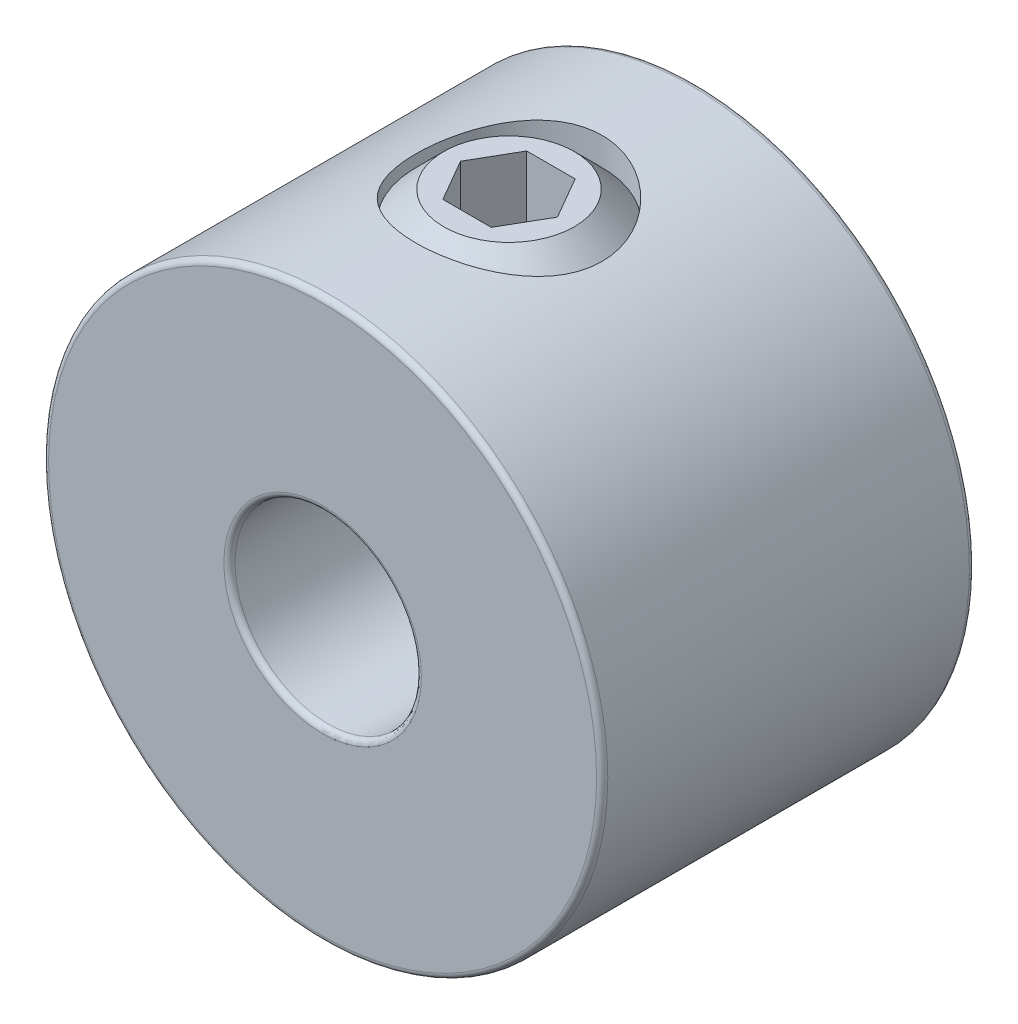
ISO-10303-21;
HEADER;
FILE_DESCRIPTION(('STEP AP214'),'2;1');
FILE_NAME('part.step','',(''),(''),'','','');
FILE_SCHEMA(('AUTOMOTIVE_DESIGN { 1 0 10303 214 1 1 1 1 }'));
ENDSEC;
DATA;
#1=APPLICATION_CONTEXT('core data for automotive mechanical design processes');
#2=APPLICATION_PROTOCOL_DEFINITION('international standard','automotive_design',2000,#1);
#3=PRODUCT_CONTEXT('',#1,'mechanical');
#4=PRODUCT('Part','Part','',(#3));
#5=PRODUCT_RELATED_PRODUCT_CATEGORY('part','',(#4));
#6=PRODUCT_DEFINITION_FORMATION('','',#4);
#7=PRODUCT_DEFINITION_CONTEXT('part definition',#1,'design');
#8=PRODUCT_DEFINITION('design','',#6,#7);
#9=PRODUCT_DEFINITION_SHAPE('','',#8);
#10=(LENGTH_UNIT() NAMED_UNIT(*) SI_UNIT(.MILLI.,.METRE.));
#11=(NAMED_UNIT(*) PLANE_ANGLE_UNIT() SI_UNIT($,.RADIAN.));
#12=(NAMED_UNIT(*) SI_UNIT($,.STERADIAN.) SOLID_ANGLE_UNIT());
#13=UNCERTAINTY_MEASURE_WITH_UNIT(LENGTH_MEASURE(1.E-05),#10,'distance_accuracy_value','');
#14=(GEOMETRIC_REPRESENTATION_CONTEXT(3) GLOBAL_UNCERTAINTY_ASSIGNED_CONTEXT((#13)) GLOBAL_UNIT_ASSIGNED_CONTEXT((#10,
#11,#12)) REPRESENTATION_CONTEXT('',''));
#15=CARTESIAN_POINT('',(0.,0.,0.));
#16=DIRECTION('',(0.,0.,1.));
#17=DIRECTION('',(1.,0.,0.));
#18=AXIS2_PLACEMENT_3D('',#15,#16,#17);
#19=CARTESIAN_POINT('',(0.,0.3,2.));
#20=DIRECTION('',(0.,1.,0.));
#21=DIRECTION('',(-1.,0.,0.));
#22=AXIS2_PLACEMENT_3D('',#19,#20,#21);
#23=CONICAL_SURFACE('',#22,1.,0.785398163397447);
#24=CARTESIAN_POINT('',(0.,0.,2.));
#25=DIRECTION('',(0.,-1.,0.));
#26=DIRECTION('',(1.,0.,0.));
#27=AXIS2_PLACEMENT_3D('',#24,#25,#26);
#28=CIRCLE('',#27,0.7);
#29=CARTESIAN_POINT('',(0.7,0.,2.));
#30=VERTEX_POINT('',#29);
#31=EDGE_CURVE('E12',#30,#30,#28,.T.);
#32=ORIENTED_EDGE('',*,*,#31,.F.);
#33=EDGE_LOOP('',(#32));
#34=FACE_BOUND('',#33,.T.);
#35=CARTESIAN_POINT('',(0.,0.3,2.));
#36=DIRECTION('',(0.,-1.,0.));
#37=DIRECTION('',(1.,0.,0.));
#38=AXIS2_PLACEMENT_3D('',#35,#36,#37);
#39=CIRCLE('',#38,1.);
#40=CARTESIAN_POINT('',(1.,0.3,2.));
#41=VERTEX_POINT('',#40);
#42=EDGE_CURVE('E145',#41,#41,#39,.T.);
#43=ORIENTED_EDGE('',*,*,#42,.T.);
#44=EDGE_LOOP('',(#43));
#45=FACE_BOUND('',#44,.T.);
#46=ADVANCED_FACE('F44',(#34,#45),#23,.T.);
#47=CARTESIAN_POINT('',(0.,0.,2.));
#48=DIRECTION('',(0.,1.,0.));
#49=DIRECTION('',(-1.,0.,0.));
#50=AXIS2_PLACEMENT_3D('',#47,#48,#49);
#51=PLANE('',#50);
#52=ORIENTED_EDGE('',*,*,#31,.T.);
#53=EDGE_LOOP('',(#52));
#54=FACE_BOUND('',#53,.T.);
#55=ADVANCED_FACE('F162',(#54),#51,.F.);
#56=CARTESIAN_POINT('',(0.,3.,2.));
#57=DIRECTION('',(0.,-1.,0.));
#58=DIRECTION('',(1.,0.,0.));
#59=AXIS2_PLACEMENT_3D('',#56,#57,#58);
#60=PLANE('',#59);
#61=DIRECTION('',(0.5,0.,0.866025403784438));
#62=VECTOR('',#61,1.);
#63=CARTESIAN_POINT('',(-0.519615242270676,3.,2.));
#64=LINE('',#63,#62);
#65=CARTESIAN_POINT('',(-0.519615242270676,3.,2.));
#66=VERTEX_POINT('',#65);
#67=CARTESIAN_POINT('',(-0.259807621135343,3.,2.45));
#68=VERTEX_POINT('',#67);
#69=EDGE_CURVE('E132',#66,#68,#64,.T.);
#70=ORIENTED_EDGE('',*,*,#69,.F.);
#71=DIRECTION('',(-0.5,0.,0.866025403784438));
#72=VECTOR('',#71,1.);
#73=CARTESIAN_POINT('',(-0.259807621135346,3.,1.55));
#74=LINE('',#73,#72);
#75=CARTESIAN_POINT('',(-0.259807621135346,3.,1.55));
#76=VERTEX_POINT('',#75);
#77=EDGE_CURVE('E58',#76,#66,#74,.T.);
#78=ORIENTED_EDGE('',*,*,#77,.F.);
#79=DIRECTION('',(-1.,0.,0.));
#80=VECTOR('',#79,1.);
#81=CARTESIAN_POINT('',(0.259807621135324,3.,1.55));
#82=LINE('',#81,#80);
#83=CARTESIAN_POINT('',(0.259807621135324,3.,1.55));
#84=VERTEX_POINT('',#83);
#85=EDGE_CURVE('E141',#84,#76,#82,.T.);
#86=ORIENTED_EDGE('',*,*,#85,.F.);
#87=DIRECTION('',(-0.5,0.,-0.866025403784439));
#88=VECTOR('',#87,1.);
#89=CARTESIAN_POINT('',(0.519615242270654,3.,2.));
#90=LINE('',#89,#88);
#91=CARTESIAN_POINT('',(0.519615242270654,3.,2.));
#92=VERTEX_POINT('',#91);
#93=EDGE_CURVE('E139',#92,#84,#90,.T.);
#94=ORIENTED_EDGE('',*,*,#93,.F.);
#95=DIRECTION('',(0.5,0.,-0.866025403784439));
#96=VECTOR('',#95,1.);
#97=CARTESIAN_POINT('',(0.259807621135322,3.,2.45));
#98=LINE('',#97,#96);
#99=CARTESIAN_POINT('',(0.259807621135322,3.,2.45));
#100=VERTEX_POINT('',#99);
#101=EDGE_CURVE('E106',#100,#92,#98,.T.);
#102=ORIENTED_EDGE('',*,*,#101,.F.);
#103=DIRECTION('',(1.,0.,0.));
#104=VECTOR('',#103,1.);
#105=CARTESIAN_POINT('',(-0.259807621135343,3.,2.45));
#106=LINE('',#105,#104);
#107=EDGE_CURVE('E135',#68,#100,#106,.T.);
#108=ORIENTED_EDGE('',*,*,#107,.F.);
#109=EDGE_LOOP('',(#70,#78,#86,#94,#102,#108));
#110=FACE_BOUND('',#109,.T.);
#111=CARTESIAN_POINT('',(0.,3.,2.));
#112=DIRECTION('',(0.,-1.,0.));
#113=DIRECTION('',(1.,0.,0.));
#114=AXIS2_PLACEMENT_3D('',#111,#112,#113);
#115=CIRCLE('',#114,0.7);
#116=CARTESIAN_POINT('',(0.699999999999999,3.,2.));
#117=VERTEX_POINT('',#116);
#118=EDGE_CURVE('E51',#117,#117,#115,.T.);
#119=ORIENTED_EDGE('',*,*,#118,.F.);
#120=EDGE_LOOP('',(#119));
#121=FACE_BOUND('',#120,.T.);
#122=ADVANCED_FACE('F160',(#110,#121),#60,.F.);
#123=CARTESIAN_POINT('',(0.,3.,2.));
#124=DIRECTION('',(0.,-1.,0.));
#125=DIRECTION('',(1.,0.,0.));
#126=AXIS2_PLACEMENT_3D('',#123,#124,#125);
#127=CONICAL_SURFACE('',#126,0.7,0.785398163397446);
#128=CARTESIAN_POINT('',(0.,2.7,2.));
#129=DIRECTION('',(0.,-1.,0.));
#130=DIRECTION('',(1.,0.,0.));
#131=AXIS2_PLACEMENT_3D('',#128,#129,#130);
#132=CIRCLE('',#131,1.);
#133=CARTESIAN_POINT('',(0.999999999999999,2.7,2.));
#134=VERTEX_POINT('',#133);
#135=EDGE_CURVE('E153',#134,#134,#132,.T.);
#136=ORIENTED_EDGE('',*,*,#135,.F.);
#137=EDGE_LOOP('',(#136));
#138=FACE_BOUND('',#137,.T.);
#139=ORIENTED_EDGE('',*,*,#118,.T.);
#140=EDGE_LOOP('',(#139));
#141=FACE_BOUND('',#140,.T.);
#142=ADVANCED_FACE('F158',(#138,#141),#127,.T.);
#143=CARTESIAN_POINT('',(0.,0.,2.));
#144=DIRECTION('',(0.,-1.,0.));
#145=DIRECTION('',(1.,0.,0.));
#146=AXIS2_PLACEMENT_3D('',#143,#144,#145);
#147=CYLINDRICAL_SURFACE('',#146,1.);
#148=ORIENTED_EDGE('',*,*,#42,.F.);
#149=EDGE_LOOP('',(#148));
#150=FACE_BOUND('',#149,.T.);
#151=ORIENTED_EDGE('',*,*,#135,.T.);
#152=EDGE_LOOP('',(#151));
#153=FACE_BOUND('',#152,.T.);
#154=ADVANCED_FACE('F169',(#150,#153),#147,.T.);
#155=CARTESIAN_POINT('',(-0.259807621135346,2.28,1.55));
#156=DIRECTION('',(-0.866025403784438,0.,-0.5));
#157=DIRECTION('',(-0.5,0.,0.866025403784438));
#158=AXIS2_PLACEMENT_3D('',#155,#156,#157);
#159=PLANE('',#158);
#160=ORIENTED_EDGE('',*,*,#77,.T.);
#161=DIRECTION('',(0.,1.,0.));
#162=VECTOR('',#161,1.);
#163=CARTESIAN_POINT('',(-0.519615242270676,2.28,2.));
#164=LINE('',#163,#162);
#165=CARTESIAN_POINT('',(-0.519615242270676,2.28,2.));
#166=VERTEX_POINT('',#165);
#167=EDGE_CURVE('E88',#166,#66,#164,.T.);
#168=ORIENTED_EDGE('',*,*,#167,.F.);
#169=DIRECTION('',(-0.5,0.,0.866025403784438));
#170=VECTOR('',#169,1.);
#171=CARTESIAN_POINT('',(-0.259807621135346,2.28,1.55));
#172=LINE('',#171,#170);
#173=CARTESIAN_POINT('',(-0.259807621135346,2.28,1.55));
#174=VERTEX_POINT('',#173);
#175=EDGE_CURVE('E143',#174,#166,#172,.T.);
#176=ORIENTED_EDGE('',*,*,#175,.F.);
#177=DIRECTION('',(0.,1.,0.));
#178=VECTOR('',#177,1.);
#179=CARTESIAN_POINT('',(-0.259807621135346,2.28,1.55));
#180=LINE('',#179,#178);
#181=EDGE_CURVE('E66',#174,#76,#180,.T.);
#182=ORIENTED_EDGE('',*,*,#181,.T.);
#183=EDGE_LOOP('',(#160,#168,#176,#182));
#184=FACE_BOUND('',#183,.T.);
#185=ADVANCED_FACE('F184',(#184),#159,.F.);
#186=CARTESIAN_POINT('',(0.259807621135324,2.28,1.55));
#187=DIRECTION('',(0.,0.,-1.));
#188=DIRECTION('',(-1.,0.,0.));
#189=AXIS2_PLACEMENT_3D('',#186,#187,#188);
#190=PLANE('',#189);
#191=ORIENTED_EDGE('',*,*,#85,.T.);
#192=ORIENTED_EDGE('',*,*,#181,.F.);
#193=DIRECTION('',(-1.,0.,0.));
#194=VECTOR('',#193,1.);
#195=CARTESIAN_POINT('',(0.259807621135324,2.28,1.55));
#196=LINE('',#195,#194);
#197=CARTESIAN_POINT('',(0.259807621135324,2.28,1.55));
#198=VERTEX_POINT('',#197);
#199=EDGE_CURVE('E118',#198,#174,#196,.T.);
#200=ORIENTED_EDGE('',*,*,#199,.F.);
#201=DIRECTION('',(0.,1.,0.));
#202=VECTOR('',#201,1.);
#203=CARTESIAN_POINT('',(0.259807621135324,2.28,1.55));
#204=LINE('',#203,#202);
#205=EDGE_CURVE('E110',#198,#84,#204,.T.);
#206=ORIENTED_EDGE('',*,*,#205,.T.);
#207=EDGE_LOOP('',(#191,#192,#200,#206));
#208=FACE_BOUND('',#207,.T.);
#209=ADVANCED_FACE('F190',(#208),#190,.F.);
#210=CARTESIAN_POINT('',(0.519615242270654,2.28,2.));
#211=DIRECTION('',(0.866025403784439,0.,-0.5));
#212=DIRECTION('',(-0.5,0.,-0.866025403784439));
#213=AXIS2_PLACEMENT_3D('',#210,#211,#212);
#214=PLANE('',#213);
#215=ORIENTED_EDGE('',*,*,#93,.T.);
#216=ORIENTED_EDGE('',*,*,#205,.F.);
#217=DIRECTION('',(-0.5,0.,-0.866025403784439));
#218=VECTOR('',#217,1.);
#219=CARTESIAN_POINT('',(0.519615242270654,2.28,2.));
#220=LINE('',#219,#218);
#221=CARTESIAN_POINT('',(0.519615242270654,2.28,2.));
#222=VERTEX_POINT('',#221);
#223=EDGE_CURVE('E114',#222,#198,#220,.T.);
#224=ORIENTED_EDGE('',*,*,#223,.F.);
#225=DIRECTION('',(0.,1.,0.));
#226=VECTOR('',#225,1.);
#227=CARTESIAN_POINT('',(0.519615242270654,2.28,2.));
#228=LINE('',#227,#226);
#229=EDGE_CURVE('E99',#222,#92,#228,.T.);
#230=ORIENTED_EDGE('',*,*,#229,.T.);
#231=EDGE_LOOP('',(#215,#216,#224,#230));
#232=FACE_BOUND('',#231,.T.);
#233=ADVANCED_FACE('F115',(#232),#214,.F.);
#234=CARTESIAN_POINT('',(0.259807621135322,2.28,2.45));
#235=DIRECTION('',(0.866025403784439,0.,0.5));
#236=DIRECTION('',(0.5,0.,-0.866025403784439));
#237=AXIS2_PLACEMENT_3D('',#234,#235,#236);
#238=PLANE('',#237);
#239=ORIENTED_EDGE('',*,*,#101,.T.);
#240=ORIENTED_EDGE('',*,*,#229,.F.);
#241=DIRECTION('',(0.5,0.,-0.866025403784439));
#242=VECTOR('',#241,1.);
#243=CARTESIAN_POINT('',(0.259807621135322,2.28,2.45));
#244=LINE('',#243,#242);
#245=CARTESIAN_POINT('',(0.259807621135322,2.28,2.45));
#246=VERTEX_POINT('',#245);
#247=EDGE_CURVE('E103',#246,#222,#244,.T.);
#248=ORIENTED_EDGE('',*,*,#247,.F.);
#249=DIRECTION('',(0.,1.,0.));
#250=VECTOR('',#249,1.);
#251=CARTESIAN_POINT('',(0.259807621135322,2.28,2.45));
#252=LINE('',#251,#250);
#253=EDGE_CURVE('E111',#246,#100,#252,.T.);
#254=ORIENTED_EDGE('',*,*,#253,.T.);
#255=EDGE_LOOP('',(#239,#240,#248,#254));
#256=FACE_BOUND('',#255,.T.);
#257=ADVANCED_FACE('F101',(#256),#238,.F.);
#258=CARTESIAN_POINT('',(-0.259807621135343,2.28,2.45));
#259=DIRECTION('',(0.,0.,1.));
#260=DIRECTION('',(1.,0.,0.));
#261=AXIS2_PLACEMENT_3D('',#258,#259,#260);
#262=PLANE('',#261);
#263=ORIENTED_EDGE('',*,*,#107,.T.);
#264=ORIENTED_EDGE('',*,*,#253,.F.);
#265=DIRECTION('',(1.,0.,0.));
#266=VECTOR('',#265,1.);
#267=CARTESIAN_POINT('',(-0.259807621135343,2.28,2.45));
#268=LINE('',#267,#266);
#269=CARTESIAN_POINT('',(-0.259807621135343,2.28,2.45));
#270=VERTEX_POINT('',#269);
#271=EDGE_CURVE('E124',#270,#246,#268,.T.);
#272=ORIENTED_EDGE('',*,*,#271,.F.);
#273=DIRECTION('',(0.,1.,0.));
#274=VECTOR('',#273,1.);
#275=CARTESIAN_POINT('',(-0.259807621135343,2.28,2.45));
#276=LINE('',#275,#274);
#277=EDGE_CURVE('E148',#270,#68,#276,.T.);
#278=ORIENTED_EDGE('',*,*,#277,.T.);
#279=EDGE_LOOP('',(#263,#264,#272,#278));
#280=FACE_BOUND('',#279,.T.);
#281=ADVANCED_FACE('F196',(#280),#262,.F.);
#282=CARTESIAN_POINT('',(-0.519615242270676,2.28,2.));
#283=DIRECTION('',(-0.866025403784439,0.,0.5));
#284=DIRECTION('',(0.5,0.,0.866025403784439));
#285=AXIS2_PLACEMENT_3D('',#282,#283,#284);
#286=PLANE('',#285);
#287=ORIENTED_EDGE('',*,*,#69,.T.);
#288=ORIENTED_EDGE('',*,*,#277,.F.);
#289=DIRECTION('',(0.5,0.,0.866025403784438));
#290=VECTOR('',#289,1.);
#291=CARTESIAN_POINT('',(-0.519615242270676,2.28,2.));
#292=LINE('',#291,#290);
#293=EDGE_CURVE('E126',#166,#270,#292,.T.);
#294=ORIENTED_EDGE('',*,*,#293,.F.);
#295=ORIENTED_EDGE('',*,*,#167,.T.);
#296=EDGE_LOOP('',(#287,#288,#294,#295));
#297=FACE_BOUND('',#296,.T.);
#298=ADVANCED_FACE('F193',(#297),#286,.F.);
#299=CARTESIAN_POINT('',(-0.519615242270676,2.28,2.));
#300=DIRECTION('',(0.,1.,0.));
#301=DIRECTION('',(0.,0.,1.));
#302=AXIS2_PLACEMENT_3D('',#299,#300,#301);
#303=PLANE('',#302);
#304=ORIENTED_EDGE('',*,*,#175,.T.);
#305=ORIENTED_EDGE('',*,*,#293,.T.);
#306=ORIENTED_EDGE('',*,*,#271,.T.);
#307=ORIENTED_EDGE('',*,*,#247,.T.);
#308=ORIENTED_EDGE('',*,*,#223,.T.);
#309=ORIENTED_EDGE('',*,*,#199,.T.);
#310=EDGE_LOOP('',(#304,#305,#306,#307,#308,#309));
#311=FACE_BOUND('',#310,.T.);
#312=ADVANCED_FACE('F121',(#311),#303,.T.);
#313=CLOSED_SHELL('',(#46,#55,#122,#142,#154,#185,#209,#233,#257,#281,#298,#312));
#314=MANIFOLD_SOLID_BREP('B2',#313);
#315=CARTESIAN_POINT('',(0.,0.,4.));
#316=DIRECTION('',(0.,0.,1.));
#317=DIRECTION('',(1.,0.,0.));
#318=AXIS2_PLACEMENT_3D('',#315,#316,#317);
#319=PLANE('',#318);
#320=CARTESIAN_POINT('',(0.,0.,4.));
#321=DIRECTION('',(0.,0.,1.));
#322=DIRECTION('',(1.,0.,0.));
#323=AXIS2_PLACEMENT_3D('',#320,#321,#322);
#324=CIRCLE('',#323,1.06);
#325=CARTESIAN_POINT('',(1.06,0.,4.));
#326=VERTEX_POINT('',#325);
#327=EDGE_CURVE('E320',#326,#326,#324,.F.);
#328=ORIENTED_EDGE('',*,*,#327,.T.);
#329=EDGE_LOOP('',(#328));
#330=FACE_BOUND('',#329,.T.);
#331=CARTESIAN_POINT('',(0.,0.,4.));
#332=DIRECTION('',(0.,0.,1.));
#333=DIRECTION('',(1.,0.,0.));
#334=AXIS2_PLACEMENT_3D('',#331,#332,#333);
#335=CIRCLE('',#334,2.94);
#336=CARTESIAN_POINT('',(2.94,0.,4.));
#337=VERTEX_POINT('',#336);
#338=EDGE_CURVE('E317',#337,#337,#335,.T.);
#339=ORIENTED_EDGE('',*,*,#338,.T.);
#340=EDGE_LOOP('',(#339));
#341=FACE_BOUND('',#340,.T.);
#342=ADVANCED_FACE('F279',(#330,#341),#319,.T.);
#343=CARTESIAN_POINT('',(0.,0.,0.));
#344=DIRECTION('',(0.,0.,1.));
#345=DIRECTION('',(1.,0.,0.));
#346=AXIS2_PLACEMENT_3D('',#343,#344,#345);
#347=PLANE('',#346);
#348=CARTESIAN_POINT('',(0.,0.,0.));
#349=DIRECTION('',(0.,0.,1.));
#350=DIRECTION('',(1.,0.,0.));
#351=AXIS2_PLACEMENT_3D('',#348,#349,#350);
#352=CIRCLE('',#351,1.06);
#353=CARTESIAN_POINT('',(1.06,0.,0.));
#354=VERTEX_POINT('',#353);
#355=EDGE_CURVE('E305',#354,#354,#352,.T.);
#356=ORIENTED_EDGE('',*,*,#355,.T.);
#357=EDGE_LOOP('',(#356));
#358=FACE_BOUND('',#357,.T.);
#359=CARTESIAN_POINT('',(0.,0.,0.));
#360=DIRECTION('',(0.,0.,1.));
#361=DIRECTION('',(1.,0.,0.));
#362=AXIS2_PLACEMENT_3D('',#359,#360,#361);
#363=CIRCLE('',#362,2.94);
#364=CARTESIAN_POINT('',(2.94,0.,0.));
#365=VERTEX_POINT('',#364);
#366=EDGE_CURVE('E302',#365,#365,#363,.F.);
#367=ORIENTED_EDGE('',*,*,#366,.T.);
#368=EDGE_LOOP('',(#367));
#369=FACE_BOUND('',#368,.T.);
#370=ADVANCED_FACE('F334',(#358,#369),#347,.F.);
#371=CARTESIAN_POINT('',(0.,0.,4.));
#372=DIRECTION('',(0.,0.,-1.));
#373=DIRECTION('',(-1.,0.,0.));
#374=AXIS2_PLACEMENT_3D('',#371,#372,#373);
#375=CYLINDRICAL_SURFACE('',#374,3.);
#376=CARTESIAN_POINT('',(0.,0.,0.0600000000000002));
#377=DIRECTION('',(0.,0.,1.));
#378=DIRECTION('',(1.,0.,0.));
#379=AXIS2_PLACEMENT_3D('',#376,#377,#378);
#380=CIRCLE('',#379,3.);
#381=CARTESIAN_POINT('',(3.,0.,0.0600000000000002));
#382=VERTEX_POINT('',#381);
#383=EDGE_CURVE('E42',#382,#382,#380,.T.);
#384=ORIENTED_EDGE('',*,*,#383,.T.);
#385=EDGE_LOOP('',(#384));
#386=FACE_BOUND('',#385,.T.);
#387=CARTESIAN_POINT('',(0.,0.,3.94));
#388=DIRECTION('',(0.,0.,1.));
#389=DIRECTION('',(1.,0.,0.));
#390=AXIS2_PLACEMENT_3D('',#387,#388,#389);
#391=CIRCLE('',#390,3.);
#392=CARTESIAN_POINT('',(3.,0.,3.94));
#393=VERTEX_POINT('',#392);
#394=EDGE_CURVE('E287',#393,#393,#391,.F.);
#395=ORIENTED_EDGE('',*,*,#394,.T.);
#396=EDGE_LOOP('',(#395));
#397=FACE_BOUND('',#396,.T.);
#398=CARTESIAN_POINT('',(0.,3.,3.));
#399=CARTESIAN_POINT('',(-0.0545633628867234,3.00000015300943,3.00000025373164));
#400=CARTESIAN_POINT('',(-0.10912519453855,2.99849769507545,2.99551973387278));
#401=CARTESIAN_POINT('',(-0.216641760872972,2.99265210203281,2.97777089118278));
#402=CARTESIAN_POINT('',(-0.269596328118818,2.98830867202153,2.96450165605108));
#403=CARTESIAN_POINT('',(-0.372332789501776,2.97725307906443,2.92968075661595));
#404=CARTESIAN_POINT('',(-0.422119825886034,2.97054487730853,2.90814293754073));
#405=CARTESIAN_POINT('',(-0.517374936805325,2.95544445717342,2.85745882716165));
#406=CARTESIAN_POINT('',(-0.562842156958706,2.94705190667778,2.8283110349974));
#407=CARTESIAN_POINT('',(-0.649741675022266,2.92914094443005,2.76217419514125));
#408=CARTESIAN_POINT('',(-0.691003700298309,2.91959556463785,2.72496876573951));
#409=CARTESIAN_POINT('',(-0.766832692702084,2.90060314783122,2.64423284529343));
#410=CARTESIAN_POINT('',(-0.801398185489463,2.89115613290549,2.60070096507149));
#411=CARTESIAN_POINT('',(-0.863824942227859,2.87313332477274,2.50701488480354));
#412=CARTESIAN_POINT('',(-0.891464858221032,2.86459039275688,2.45670626026788));
#413=CARTESIAN_POINT('',(-0.937818873877722,2.84975305418601,2.35182390554145));
#414=CARTESIAN_POINT('',(-0.956535697386765,2.84345796160746,2.29725148283726));
#415=CARTESIAN_POINT('',(-0.983873461509163,2.83411303269377,2.18732677850329));
#416=CARTESIAN_POINT('',(-0.992813448271769,2.83096095769611,2.13206279151094));
#417=CARTESIAN_POINT('',(-1.00134112333448,2.82795656629508,2.02073624584412));
#418=CARTESIAN_POINT('',(-1.00093170160472,2.8281032302273,1.96467393929081));
#419=CARTESIAN_POINT('',(-0.991019903703419,2.8315901500818,1.85606336955598));
#420=CARTESIAN_POINT('',(-0.981933913166995,2.83478415867533,1.80347159708098));
#421=CARTESIAN_POINT('',(-0.955606162849417,2.84376657724551,1.70060658039317));
#422=CARTESIAN_POINT('',(-0.938363426591871,2.84955529784108,1.65033361456493));
#423=CARTESIAN_POINT('',(-0.895939058060211,2.86317911131249,1.55258725040852));
#424=CARTESIAN_POINT('',(-0.870634048707262,2.87104565793117,1.50517197453047));
#425=CARTESIAN_POINT('',(-0.812889106303139,2.88792558575726,1.41512909172027));
#426=CARTESIAN_POINT('',(-0.780447112364005,2.89693929790464,1.37250287306662));
#427=CARTESIAN_POINT('',(-0.707349332682237,2.91567329167741,1.29090840183923));
#428=CARTESIAN_POINT('',(-0.666353150076311,2.92540589354843,1.25224730549093));
#429=CARTESIAN_POINT('',(-0.578339569970064,2.94406938387037,1.1822687333366));
#430=CARTESIAN_POINT('',(-0.531321595660814,2.95300019538067,1.1509519618355));
#431=CARTESIAN_POINT('',(-0.431947613046267,2.96917107937794,1.09630369976493));
#432=CARTESIAN_POINT('',(-0.379543276416336,2.97639350008039,1.07305450865927));
#433=CARTESIAN_POINT('',(-0.271269083364507,2.98820567144435,1.03579682604429));
#434=CARTESIAN_POINT('',(-0.215400438154954,2.99279633654879,1.02178512457656));
#435=CARTESIAN_POINT('',(-0.104383829529303,2.99867627071441,1.00394433397764));
#436=CARTESIAN_POINT('',(-0.049309599864845,3.00010001833731,0.999700190827251));
#437=CARTESIAN_POINT('',(0.0607750699602367,2.99988902694825,1.00033267359847));
#438=CARTESIAN_POINT('',(0.115785519319647,2.99825480419352,1.00520775997987));
#439=CARTESIAN_POINT('',(0.222519866304259,2.99220024717114,1.02361190773597));
#440=CARTESIAN_POINT('',(0.274292806834856,2.98786198711228,1.03688620604952));
#441=CARTESIAN_POINT('',(0.374855958579561,2.97691846830034,1.0713934444667));
#442=CARTESIAN_POINT('',(0.42364578850856,2.97031292046541,1.09262739946767));
#443=CARTESIAN_POINT('',(0.518288296393322,2.95528931287427,1.1430704318409));
#444=CARTESIAN_POINT('',(0.56402995921733,2.94682814756305,1.1724745932836));
#445=CARTESIAN_POINT('',(0.650064830135404,2.92905253915743,1.23819415001305));
#446=CARTESIAN_POINT('',(0.690356367794894,2.91973783591888,1.27451165603016));
#447=CARTESIAN_POINT('',(0.766252507807014,2.90076847982472,1.35497875100826));
#448=CARTESIAN_POINT('',(0.801560969248492,2.89111761095155,1.39940922693325));
#449=CARTESIAN_POINT('',(0.864257522320854,2.87299973286981,1.4937715678045));
#450=CARTESIAN_POINT('',(0.891645547920844,2.8645327335312,1.5437034786102));
#451=CARTESIAN_POINT('',(0.937596930423361,2.84982391820308,1.6476730153066));
#452=CARTESIAN_POINT('',(0.956178132197766,2.84357760900632,1.70170207924278));
#453=CARTESIAN_POINT('',(0.983894666792163,2.83410832399133,1.81237865012415));
#454=CARTESIAN_POINT('',(0.993034254961244,2.83088398622698,1.86902496543306));
#455=CARTESIAN_POINT('',(1.00127628247038,2.82797858875071,1.98019709601321));
#456=CARTESIAN_POINT('',(1.00087025731093,2.82812400344299,2.03468234025174));
#457=CARTESIAN_POINT('',(0.991242293454878,2.8315126992356,2.14276507489974));
#458=CARTESIAN_POINT('',(0.982020879458887,2.83475579595884,2.19636261795291));
#459=CARTESIAN_POINT('',(0.95537181312698,2.84384524278943,2.30013566301267));
#460=CARTESIAN_POINT('',(0.938103346014879,2.84964098015514,2.35035682500723));
#461=CARTESIAN_POINT('',(0.895979365760381,2.86316398825434,2.44722740693553));
#462=CARTESIAN_POINT('',(0.871122168553978,2.87089168765297,2.49387603118726));
#463=CARTESIAN_POINT('',(0.813260692583248,2.8878282922406,2.58448366992369));
#464=CARTESIAN_POINT('',(0.779948242764531,2.89708711641604,2.6282365018986));
#465=CARTESIAN_POINT('',(0.706642883135697,2.91583356283786,2.70968981338399));
#466=CARTESIAN_POINT('',(0.666648084451494,2.92532124912518,2.74738857568802));
#467=CARTESIAN_POINT('',(0.579241556920674,2.94390030525393,2.81714441228924));
#468=CARTESIAN_POINT('',(0.531601513499725,2.95296181801216,2.84892434775102));
#469=CARTESIAN_POINT('',(0.431357357406628,2.96925991172652,2.90399042885063));
#470=CARTESIAN_POINT('',(0.378754518132349,2.97649695907941,2.92727874592204));
#471=CARTESIAN_POINT('',(0.272493647200974,2.98805515068532,2.96372163248868));
#472=CARTESIAN_POINT('',(0.218987757676408,2.9924921242252,2.97728246626338));
#473=CARTESIAN_POINT('',(0.110320416010247,2.99846407064225,2.99542028067713));
#474=CARTESIAN_POINT('',(0.0551594255687462,2.99999984531906,2.99999974349654));
#475=CARTESIAN_POINT('',(0.,3.,3.));
#476=B_SPLINE_CURVE_WITH_KNOTS('',3,(#398,#399,#400,#401,#402,#403,#404,#405,#406,#407,#408,
#409,#410,#411,#412,#413,#414,#415,#416,#417,#418,#419,#420,#421,#422,#423,#424,#425,#426,#427,
#428,#429,#430,#431,#432,#433,#434,#435,#436,#437,#438,#439,#440,#441,#442,#443,#444,#445,#446,
#447,#448,#449,#450,#451,#452,#453,#454,#455,#456,#457,#458,#459,#460,#461,#462,#463,#464,#465,
#466,#467,#468,#469,#470,#471,#472,#473,#474,#475),.UNSPECIFIED.,.T.,.F.,(4,2,2,2,2,2,2,2,2,2,2,
2,2,2,2,2,2,2,2,2,2,2,2,2,2,2,2,2,2,2,2,2,2,2,2,2,2,2,4),(0.,0.163487106026011,
0.326991185267521,0.490222672870274,0.6534863777991,0.82184684282756,0.990244332875303,
1.16348384823471,1.33667044692833,1.5040192574184,1.67131633987485,1.8309682655128,
1.99063930855482,2.15288171155131,2.31517102558207,2.48593305811367,2.65671145966618,
2.82918405650358,3.00159668877208,3.1665358317517,3.33144713164177,3.49158157978213,
3.65173645284104,3.81610399843737,3.98052180821891,4.15241022880752,4.32430008234997,
4.49584013824416,4.66730284700846,4.82995666056619,4.99260079341185,5.15215587070228,
5.31174638165788,5.47830066681615,5.64490211113589,5.8179966082491,5.99104681142266,
6.15636558363624,6.3216386602795),.UNSPECIFIED.);
#477=CARTESIAN_POINT('',(0.,3.,3.));
#478=VERTEX_POINT('',#477);
#479=EDGE_CURVE('E299',#478,#478,#476,.T.);
#480=ORIENTED_EDGE('',*,*,#479,.T.);
#481=EDGE_LOOP('',(#480));
#482=FACE_BOUND('',#481,.T.);
#483=ADVANCED_FACE('F325',(#386,#397,#482),#375,.T.);
#484=CARTESIAN_POINT('',(0.,0.,4.));
#485=DIRECTION('',(0.,0.,-1.));
#486=DIRECTION('',(-1.,0.,0.));
#487=AXIS2_PLACEMENT_3D('',#484,#485,#486);
#488=CYLINDRICAL_SURFACE('',#487,1.);
#489=CARTESIAN_POINT('',(0.,0.,0.0600000000000002));
#490=DIRECTION('',(0.,0.,1.));
#491=DIRECTION('',(1.,0.,0.));
#492=AXIS2_PLACEMENT_3D('',#489,#490,#491);
#493=CIRCLE('',#492,1.);
#494=CARTESIAN_POINT('',(1.,0.,0.0600000000000002));
#495=VERTEX_POINT('',#494);
#496=EDGE_CURVE('E314',#495,#495,#493,.F.);
#497=ORIENTED_EDGE('',*,*,#496,.T.);
#498=EDGE_LOOP('',(#497));
#499=FACE_BOUND('',#498,.T.);
#500=CARTESIAN_POINT('',(0.,0.,3.94));
#501=DIRECTION('',(0.,0.,1.));
#502=DIRECTION('',(1.,0.,0.));
#503=AXIS2_PLACEMENT_3D('',#500,#501,#502);
#504=CIRCLE('',#503,1.);
#505=CARTESIAN_POINT('',(1.,0.,3.94));
#506=VERTEX_POINT('',#505);
#507=EDGE_CURVE('E311',#506,#506,#504,.T.);
#508=ORIENTED_EDGE('',*,*,#507,.T.);
#509=EDGE_LOOP('',(#508));
#510=FACE_BOUND('',#509,.T.);
#511=CARTESIAN_POINT('',(0.,0.,2.));
#512=DIRECTION('',(0.,0.707106781186547,-0.707106781186547));
#513=DIRECTION('',(0.,-0.707106781186547,-0.707106781186547));
#514=AXIS2_PLACEMENT_3D('',#511,#512,#513);
#515=ELLIPSE('',#514,1.41421356237309,1.);
#516=CARTESIAN_POINT('',(1.,0.,2.));
#517=VERTEX_POINT('',#516);
#518=CARTESIAN_POINT('',(-1.,0.,2.));
#519=VERTEX_POINT('',#518);
#520=EDGE_CURVE('E293',#517,#519,#515,.F.);
#521=ORIENTED_EDGE('',*,*,#520,.F.);
#522=CARTESIAN_POINT('',(0.,0.,2.));
#523=DIRECTION('',(0.,-0.707106781186547,-0.707106781186547));
#524=DIRECTION('',(0.,0.707106781186547,-0.707106781186547));
#525=AXIS2_PLACEMENT_3D('',#522,#523,#524);
#526=ELLIPSE('',#525,1.41421356237309,1.);
#527=EDGE_CURVE('E295',#519,#517,#526,.T.);
#528=ORIENTED_EDGE('',*,*,#527,.F.);
#529=EDGE_LOOP('',(#521,#528));
#530=FACE_BOUND('',#529,.T.);
#531=ADVANCED_FACE('F301',(#499,#510,#530),#488,.F.);
#532=CARTESIAN_POINT('',(0.,-2.82842712474619,2.));
#533=DIRECTION('',(0.,1.,0.));
#534=DIRECTION('',(0.,0.,1.));
#535=AXIS2_PLACEMENT_3D('',#532,#533,#534);
#536=CYLINDRICAL_SURFACE('',#535,1.);
#537=ORIENTED_EDGE('',*,*,#520,.T.);
#538=ORIENTED_EDGE('',*,*,#527,.T.);
#539=EDGE_LOOP('',(#537,#538));
#540=FACE_BOUND('',#539,.T.);
#541=ORIENTED_EDGE('',*,*,#479,.F.);
#542=EDGE_LOOP('',(#541));
#543=FACE_BOUND('',#542,.T.);
#544=ADVANCED_FACE('F296',(#540,#543),#536,.F.);
#545=CARTESIAN_POINT('',(0.,0.,0.0600000000000002));
#546=DIRECTION('',(0.,0.,1.));
#547=DIRECTION('',(1.,0.,0.));
#548=AXIS2_PLACEMENT_3D('',#545,#546,#547);
#549=TOROIDAL_SURFACE('',#548,1.06,0.06);
#550=ORIENTED_EDGE('',*,*,#496,.F.);
#551=EDGE_LOOP('',(#550));
#552=FACE_BOUND('',#551,.T.);
#553=ORIENTED_EDGE('',*,*,#355,.F.);
#554=EDGE_LOOP('',(#553));
#555=FACE_BOUND('',#554,.T.);
#556=ADVANCED_FACE('F349',(#552,#555),#549,.T.);
#557=CARTESIAN_POINT('',(0.,0.,3.94));
#558=DIRECTION('',(0.,0.,1.));
#559=DIRECTION('',(1.,0.,0.));
#560=AXIS2_PLACEMENT_3D('',#557,#558,#559);
#561=TOROIDAL_SURFACE('',#560,1.06,0.06);
#562=ORIENTED_EDGE('',*,*,#327,.F.);
#563=EDGE_LOOP('',(#562));
#564=FACE_BOUND('',#563,.T.);
#565=ORIENTED_EDGE('',*,*,#507,.F.);
#566=EDGE_LOOP('',(#565));
#567=FACE_BOUND('',#566,.T.);
#568=ADVANCED_FACE('F360',(#564,#567),#561,.T.);
#569=CARTESIAN_POINT('',(0.,0.,0.0600000000000002));
#570=DIRECTION('',(0.,0.,1.));
#571=DIRECTION('',(1.,0.,0.));
#572=AXIS2_PLACEMENT_3D('',#569,#570,#571);
#573=TOROIDAL_SURFACE('',#572,2.94,0.06);
#574=ORIENTED_EDGE('',*,*,#366,.F.);
#575=EDGE_LOOP('',(#574));
#576=FACE_BOUND('',#575,.T.);
#577=ORIENTED_EDGE('',*,*,#383,.F.);
#578=EDGE_LOOP('',(#577));
#579=FACE_BOUND('',#578,.T.);
#580=ADVANCED_FACE('F330',(#576,#579),#573,.T.);
#581=CARTESIAN_POINT('',(0.,0.,3.94));
#582=DIRECTION('',(0.,0.,1.));
#583=DIRECTION('',(1.,0.,0.));
#584=AXIS2_PLACEMENT_3D('',#581,#582,#583);
#585=TOROIDAL_SURFACE('',#584,2.94,0.06);
#586=ORIENTED_EDGE('',*,*,#394,.F.);
#587=EDGE_LOOP('',(#586));
#588=FACE_BOUND('',#587,.T.);
#589=ORIENTED_EDGE('',*,*,#338,.F.);
#590=EDGE_LOOP('',(#589));
#591=FACE_BOUND('',#590,.T.);
#592=ADVANCED_FACE('F281',(#588,#591),#585,.T.);
#593=CLOSED_SHELL('',(#342,#370,#483,#531,#544,#556,#568,#580,#592));
#594=MANIFOLD_SOLID_BREP('B6',#593);
#595=ADVANCED_BREP_SHAPE_REPRESENTATION('',(#18,#314,#594),#14);
#596=SHAPE_DEFINITION_REPRESENTATION(#9,#595);
ENDSEC;
END-ISO-10303-21;
